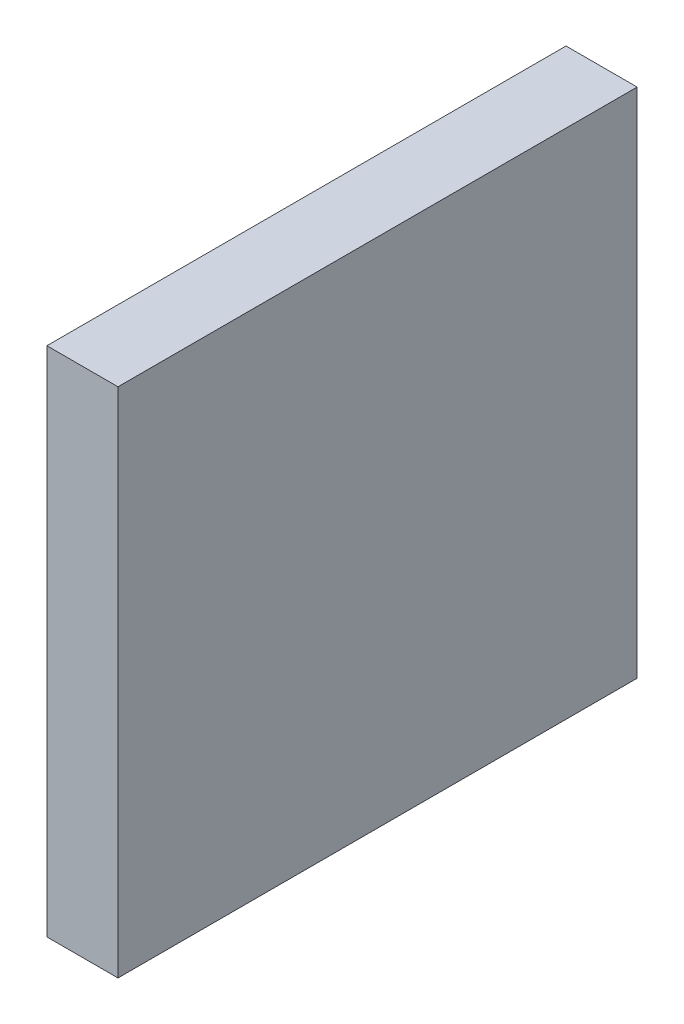
ISO-10303-21;
HEADER;
FILE_DESCRIPTION(('STEP AP214'),'2;1');
FILE_NAME('part.step','',(''),(''),'','','');
FILE_SCHEMA(('AUTOMOTIVE_DESIGN { 1 0 10303 214 1 1 1 1 }'));
ENDSEC;
DATA;
#1=APPLICATION_CONTEXT('core data for automotive mechanical design processes');
#2=APPLICATION_PROTOCOL_DEFINITION('international standard','automotive_design',2000,#1);
#3=PRODUCT_CONTEXT('',#1,'mechanical');
#4=PRODUCT('Part','Part','',(#3));
#5=PRODUCT_RELATED_PRODUCT_CATEGORY('part','',(#4));
#6=PRODUCT_DEFINITION_FORMATION('','',#4);
#7=PRODUCT_DEFINITION_CONTEXT('part definition',#1,'design');
#8=PRODUCT_DEFINITION('design','',#6,#7);
#9=PRODUCT_DEFINITION_SHAPE('','',#8);
#10=(LENGTH_UNIT() NAMED_UNIT(*) SI_UNIT(.MILLI.,.METRE.));
#11=(NAMED_UNIT(*) PLANE_ANGLE_UNIT() SI_UNIT($,.RADIAN.));
#12=(NAMED_UNIT(*) SI_UNIT($,.STERADIAN.) SOLID_ANGLE_UNIT());
#13=UNCERTAINTY_MEASURE_WITH_UNIT(LENGTH_MEASURE(1.E-05),#10,'distance_accuracy_value','');
#14=(GEOMETRIC_REPRESENTATION_CONTEXT(3) GLOBAL_UNCERTAINTY_ASSIGNED_CONTEXT((#13)) GLOBAL_UNIT_ASSIGNED_CONTEXT((#10,
#11,#12)) REPRESENTATION_CONTEXT('',''));
#15=CARTESIAN_POINT('',(0.,0.,0.));
#16=DIRECTION('',(0.,0.,1.));
#17=DIRECTION('',(1.,0.,0.));
#18=AXIS2_PLACEMENT_3D('',#15,#16,#17);
#19=CARTESIAN_POINT('',(6.35,0.,0.));
#20=DIRECTION('',(0.,0.,-1.));
#21=DIRECTION('',(-1.,0.,0.));
#22=AXIS2_PLACEMENT_3D('',#19,#20,#21);
#23=PLANE('',#22);
#24=DIRECTION('',(0.,-1.,0.));
#25=VECTOR('',#24,1.);
#26=CARTESIAN_POINT('',(0.,0.,0.));
#27=LINE('',#26,#25);
#28=CARTESIAN_POINT('',(0.,45.72,0.));
#29=VERTEX_POINT('',#28);
#30=CARTESIAN_POINT('',(0.,0.,0.));
#31=VERTEX_POINT('',#30);
#32=EDGE_CURVE('E96',#29,#31,#27,.T.);
#33=ORIENTED_EDGE('',*,*,#32,.T.);
#34=DIRECTION('',(-1.,0.,0.));
#35=VECTOR('',#34,1.);
#36=CARTESIAN_POINT('',(6.35,0.,0.));
#37=LINE('',#36,#35);
#38=CARTESIAN_POINT('',(6.35,0.,0.));
#39=VERTEX_POINT('',#38);
#40=EDGE_CURVE('E11',#39,#31,#37,.T.);
#41=ORIENTED_EDGE('',*,*,#40,.F.);
#42=DIRECTION('',(0.,-1.,0.));
#43=VECTOR('',#42,1.);
#44=CARTESIAN_POINT('',(6.35,0.,0.));
#45=LINE('',#44,#43);
#46=CARTESIAN_POINT('',(6.35,45.72,0.));
#47=VERTEX_POINT('',#46);
#48=EDGE_CURVE('E84',#47,#39,#45,.T.);
#49=ORIENTED_EDGE('',*,*,#48,.F.);
#50=DIRECTION('',(-1.,0.,0.));
#51=VECTOR('',#50,1.);
#52=CARTESIAN_POINT('',(6.35,45.72,0.));
#53=LINE('',#52,#51);
#54=EDGE_CURVE('E92',#47,#29,#53,.T.);
#55=ORIENTED_EDGE('',*,*,#54,.T.);
#56=EDGE_LOOP('',(#33,#41,#49,#55));
#57=FACE_BOUND('',#56,.T.);
#58=ADVANCED_FACE('F33',(#57),#23,.F.);
#59=CARTESIAN_POINT('',(6.35,0.,0.));
#60=DIRECTION('',(0.,1.,0.));
#61=DIRECTION('',(0.,0.,1.));
#62=AXIS2_PLACEMENT_3D('',#59,#60,#61);
#63=PLANE('',#62);
#64=DIRECTION('',(0.,0.,-1.));
#65=VECTOR('',#64,1.);
#66=CARTESIAN_POINT('',(0.,0.,0.));
#67=LINE('',#66,#65);
#68=CARTESIAN_POINT('',(0.,0.,-46.355));
#69=VERTEX_POINT('',#68);
#70=EDGE_CURVE('E88',#31,#69,#67,.T.);
#71=ORIENTED_EDGE('',*,*,#70,.T.);
#72=DIRECTION('',(-1.,0.,0.));
#73=VECTOR('',#72,1.);
#74=CARTESIAN_POINT('',(6.35,0.,-46.355));
#75=LINE('',#74,#73);
#76=CARTESIAN_POINT('',(6.35,0.,-46.355));
#77=VERTEX_POINT('',#76);
#78=EDGE_CURVE('E41',#77,#69,#75,.T.);
#79=ORIENTED_EDGE('',*,*,#78,.F.);
#80=DIRECTION('',(0.,0.,-1.));
#81=VECTOR('',#80,1.);
#82=CARTESIAN_POINT('',(6.35,0.,0.));
#83=LINE('',#82,#81);
#84=EDGE_CURVE('E79',#39,#77,#83,.T.);
#85=ORIENTED_EDGE('',*,*,#84,.F.);
#86=ORIENTED_EDGE('',*,*,#40,.T.);
#87=EDGE_LOOP('',(#71,#79,#85,#86));
#88=FACE_BOUND('',#87,.T.);
#89=ADVANCED_FACE('F87',(#88),#63,.F.);
#90=CARTESIAN_POINT('',(6.35,0.,-46.355));
#91=DIRECTION('',(0.,0.,1.));
#92=DIRECTION('',(1.,0.,0.));
#93=AXIS2_PLACEMENT_3D('',#90,#91,#92);
#94=PLANE('',#93);
#95=DIRECTION('',(0.,1.,0.));
#96=VECTOR('',#95,1.);
#97=CARTESIAN_POINT('',(0.,0.,-46.355));
#98=LINE('',#97,#96);
#99=CARTESIAN_POINT('',(0.,45.72,-46.355));
#100=VERTEX_POINT('',#99);
#101=EDGE_CURVE('E66',#69,#100,#98,.T.);
#102=ORIENTED_EDGE('',*,*,#101,.T.);
#103=DIRECTION('',(-1.,0.,0.));
#104=VECTOR('',#103,1.);
#105=CARTESIAN_POINT('',(6.35,45.72,-46.355));
#106=LINE('',#105,#104);
#107=CARTESIAN_POINT('',(6.35,45.72,-46.355));
#108=VERTEX_POINT('',#107);
#109=EDGE_CURVE('E89',#108,#100,#106,.T.);
#110=ORIENTED_EDGE('',*,*,#109,.F.);
#111=DIRECTION('',(0.,1.,0.));
#112=VECTOR('',#111,1.);
#113=CARTESIAN_POINT('',(6.35,0.,-46.355));
#114=LINE('',#113,#112);
#115=EDGE_CURVE('E82',#77,#108,#114,.T.);
#116=ORIENTED_EDGE('',*,*,#115,.F.);
#117=ORIENTED_EDGE('',*,*,#78,.T.);
#118=EDGE_LOOP('',(#102,#110,#116,#117));
#119=FACE_BOUND('',#118,.T.);
#120=ADVANCED_FACE('F90',(#119),#94,.F.);
#121=CARTESIAN_POINT('',(6.35,45.72,0.));
#122=DIRECTION('',(0.,-1.,0.));
#123=DIRECTION('',(0.,0.,-1.));
#124=AXIS2_PLACEMENT_3D('',#121,#122,#123);
#125=PLANE('',#124);
#126=DIRECTION('',(0.,0.,1.));
#127=VECTOR('',#126,1.);
#128=CARTESIAN_POINT('',(0.,45.72,0.));
#129=LINE('',#128,#127);
#130=EDGE_CURVE('E72',#100,#29,#129,.T.);
#131=ORIENTED_EDGE('',*,*,#130,.T.);
#132=ORIENTED_EDGE('',*,*,#54,.F.);
#133=DIRECTION('',(0.,0.,1.));
#134=VECTOR('',#133,1.);
#135=CARTESIAN_POINT('',(6.35,45.72,0.));
#136=LINE('',#135,#134);
#137=EDGE_CURVE('E49',#108,#47,#136,.T.);
#138=ORIENTED_EDGE('',*,*,#137,.F.);
#139=ORIENTED_EDGE('',*,*,#109,.T.);
#140=EDGE_LOOP('',(#131,#132,#138,#139));
#141=FACE_BOUND('',#140,.T.);
#142=ADVANCED_FACE('F103',(#141),#125,.F.);
#143=CARTESIAN_POINT('',(6.35,0.,0.));
#144=DIRECTION('',(-1.,0.,0.));
#145=DIRECTION('',(0.,0.,1.));
#146=AXIS2_PLACEMENT_3D('',#143,#144,#145);
#147=PLANE('',#146);
#148=ORIENTED_EDGE('',*,*,#48,.T.);
#149=ORIENTED_EDGE('',*,*,#84,.T.);
#150=ORIENTED_EDGE('',*,*,#115,.T.);
#151=ORIENTED_EDGE('',*,*,#137,.T.);
#152=EDGE_LOOP('',(#148,#149,#150,#151));
#153=FACE_BOUND('',#152,.T.);
#154=ADVANCED_FACE('F80',(#153),#147,.F.);
#155=CARTESIAN_POINT('',(0.,0.,0.));
#156=DIRECTION('',(-1.,0.,0.));
#157=DIRECTION('',(0.,0.,1.));
#158=AXIS2_PLACEMENT_3D('',#155,#156,#157);
#159=PLANE('',#158);
#160=ORIENTED_EDGE('',*,*,#32,.F.);
#161=ORIENTED_EDGE('',*,*,#130,.F.);
#162=ORIENTED_EDGE('',*,*,#101,.F.);
#163=ORIENTED_EDGE('',*,*,#70,.F.);
#164=EDGE_LOOP('',(#160,#161,#162,#163));
#165=FACE_BOUND('',#164,.T.);
#166=ADVANCED_FACE('F106',(#165),#159,.T.);
#167=CLOSED_SHELL('',(#58,#89,#120,#142,#154,#166));
#168=MANIFOLD_SOLID_BREP('B2',#167);
#169=ADVANCED_BREP_SHAPE_REPRESENTATION('',(#18,#168),#14);
#170=SHAPE_DEFINITION_REPRESENTATION(#9,#169);
ENDSEC;
END-ISO-10303-21;
